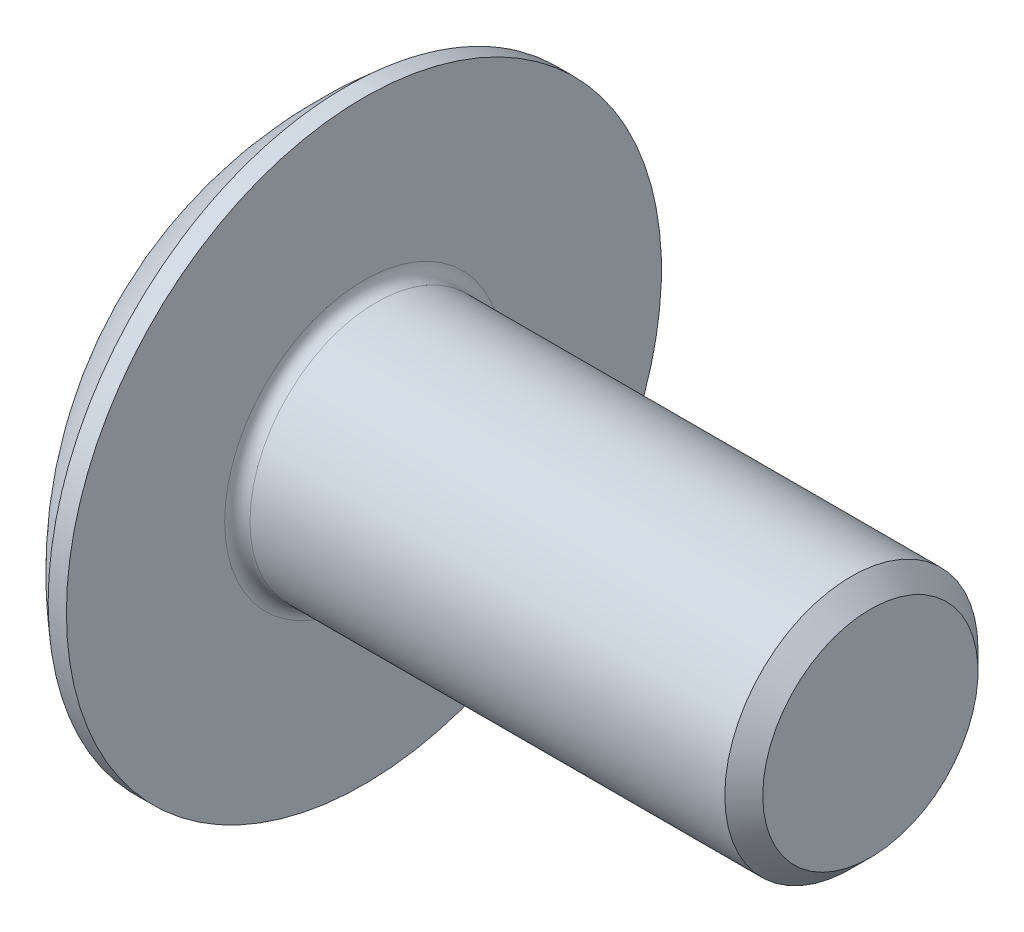
ISO-10303-21;
HEADER;
FILE_DESCRIPTION(('STEP AP214'),'2;1');
FILE_NAME('part.step','',(''),(''),'','','');
FILE_SCHEMA(('AUTOMOTIVE_DESIGN { 1 0 10303 214 1 1 1 1 }'));
ENDSEC;
DATA;
#1=APPLICATION_CONTEXT('core data for automotive mechanical design processes');
#2=APPLICATION_PROTOCOL_DEFINITION('international standard','automotive_design',2000,#1);
#3=PRODUCT_CONTEXT('',#1,'mechanical');
#4=PRODUCT('Part','Part','',(#3));
#5=PRODUCT_RELATED_PRODUCT_CATEGORY('part','',(#4));
#6=PRODUCT_DEFINITION_FORMATION('','',#4);
#7=PRODUCT_DEFINITION_CONTEXT('part definition',#1,'design');
#8=PRODUCT_DEFINITION('design','',#6,#7);
#9=PRODUCT_DEFINITION_SHAPE('','',#8);
#10=(LENGTH_UNIT() NAMED_UNIT(*) SI_UNIT(.MILLI.,.METRE.));
#11=(NAMED_UNIT(*) PLANE_ANGLE_UNIT() SI_UNIT($,.RADIAN.));
#12=(NAMED_UNIT(*) SI_UNIT($,.STERADIAN.) SOLID_ANGLE_UNIT());
#13=UNCERTAINTY_MEASURE_WITH_UNIT(LENGTH_MEASURE(1.E-05),#10,'distance_accuracy_value','');
#14=(GEOMETRIC_REPRESENTATION_CONTEXT(3) GLOBAL_UNCERTAINTY_ASSIGNED_CONTEXT((#13)) GLOBAL_UNIT_ASSIGNED_CONTEXT((#10,
#11,#12)) REPRESENTATION_CONTEXT('',''));
#15=CARTESIAN_POINT('',(0.,0.,0.));
#16=DIRECTION('',(0.,0.,1.));
#17=DIRECTION('',(1.,0.,0.));
#18=AXIS2_PLACEMENT_3D('',#15,#16,#17);
#19=CARTESIAN_POINT('',(0.,-2.15,-0.515));
#20=DIRECTION('',(0.446197753347436,-0.894934391398443,0.));
#21=DIRECTION('',(0.894934391398443,0.446197753347436,0.));
#22=AXIS2_PLACEMENT_3D('',#19,#20,#21);
#23=PLANE('',#22);
#24=DIRECTION('',(0.,0.,1.));
#25=VECTOR('',#24,1.);
#26=CARTESIAN_POINT('',(2.12999999999999,-1.08802135244247,-0.515));
#27=LINE('',#26,#25);
#28=CARTESIAN_POINT('',(2.12999999999999,-1.08802135244247,-0.515));
#29=VERTEX_POINT('',#28);
#30=CARTESIAN_POINT('',(2.12999999999999,-1.08802135244247,0.515));
#31=VERTEX_POINT('',#30);
#32=EDGE_CURVE('E160',#29,#31,#27,.T.);
#33=ORIENTED_EDGE('',*,*,#32,.F.);
#34=DIRECTION('',(0.894934391398443,0.446197753347434,0.));
#35=VECTOR('',#34,1.);
#36=CARTESIAN_POINT('',(0.351508113671697,-1.97474454874996,-0.515));
#37=LINE('',#36,#35);
#38=CARTESIAN_POINT('',(0.351508113671697,-1.97474454874997,-0.515000000000001));
#39=VERTEX_POINT('',#38);
#40=EDGE_CURVE('E142',#39,#29,#37,.T.);
#41=ORIENTED_EDGE('',*,*,#40,.F.);
#42=CARTESIAN_POINT('',(0.351508113671696,-1.97474454874997,0.514999999999999));
#43=CARTESIAN_POINT('',(0.338401527680641,-1.98127925037666,0.343333333333332));
#44=CARTESIAN_POINT('',(0.331848234685115,-1.98454660119001,0.171666666666666));
#45=CARTESIAN_POINT('',(0.331848234685121,-1.98454660119003,-0.171666666666674));
#46=CARTESIAN_POINT('',(0.338401527680654,-1.98127925037669,-0.343333333333347));
#47=CARTESIAN_POINT('',(0.351508113671716,-1.97474454875002,-0.51500000000002));
#48=B_SPLINE_CURVE_WITH_KNOTS('',3,(#42,#43,#44,#45,#46,#47),.UNSPECIFIED.,.F.,.F.,(4,2,4),(0.,
0.515468322085658,1.03093664417134),.UNSPECIFIED.);
#49=CARTESIAN_POINT('',(0.351508113671697,-1.97474454874997,0.514999999999999));
#50=VERTEX_POINT('',#49);
#51=EDGE_CURVE('E153',#50,#39,#48,.T.);
#52=ORIENTED_EDGE('',*,*,#51,.F.);
#53=DIRECTION('',(-0.894934391398443,-0.446197753347434,0.));
#54=VECTOR('',#53,1.);
#55=CARTESIAN_POINT('',(2.12999999999999,-1.08802135244247,0.515));
#56=LINE('',#55,#54);
#57=EDGE_CURVE('E174',#31,#50,#56,.T.);
#58=ORIENTED_EDGE('',*,*,#57,.F.);
#59=EDGE_LOOP('',(#33,#41,#52,#58));
#60=FACE_BOUND('',#59,.T.);
#61=ADVANCED_FACE('F17',(#60),#23,.F.);
#62=CARTESIAN_POINT('',(0.,-2.15,0.514999999999999));
#63=DIRECTION('',(0.,0.,-1.));
#64=DIRECTION('',(0.,1.,0.));
#65=AXIS2_PLACEMENT_3D('',#62,#63,#64);
#66=PLANE('',#65);
#67=DIRECTION('',(0.,1.,0.));
#68=VECTOR('',#67,1.);
#69=CARTESIAN_POINT('',(2.12999999999999,-2.15,0.515));
#70=LINE('',#69,#68);
#71=CARTESIAN_POINT('',(2.13000000001115,-0.677477674911631,0.515));
#72=VERTEX_POINT('',#71);
#73=EDGE_CURVE('E178',#72,#31,#70,.F.);
#74=ORIENTED_EDGE('',*,*,#73,.T.);
#75=ORIENTED_EDGE('',*,*,#57,.T.);
#76=CARTESIAN_POINT('',(0.351508113671694,-1.97474454874997,0.514999999999999));
#77=CARTESIAN_POINT('',(0.288655879890495,-1.79165319179448,0.515000000000059));
#78=CARTESIAN_POINT('',(0.234735010530897,-1.60641743663807,0.515000000000059));
#79=CARTESIAN_POINT('',(0.144756000654907,-1.2316571299234,0.51499999999994));
#80=CARTESIAN_POINT('',(0.108697860138513,-1.04213257836513,0.514999999999819));
#81=CARTESIAN_POINT('',(0.0815710840437224,-0.850463628605944,0.514999999999639));
#82=B_SPLINE_CURVE_WITH_KNOTS('',3,(#76,#77,#78,#79,#80,#81),.UNSPECIFIED.,.F.,.F.,(4,2,4),(0.,
0.578772585967706,1.15754517193541),.UNSPECIFIED.);
#83=CARTESIAN_POINT('',(0.0815710840406824,-0.850463628609745,0.514999999999999));
#84=VERTEX_POINT('',#83);
#85=EDGE_CURVE('E156',#50,#84,#82,.T.);
#86=ORIENTED_EDGE('',*,*,#85,.T.);
#87=CARTESIAN_POINT('',(0.081571084037665,-0.850463628613819,0.515));
#88=CARTESIAN_POINT('',(0.252311809699792,-0.836504687710256,0.515));
#89=CARTESIAN_POINT('',(0.423045275412838,-0.822456452597831,0.515));
#90=CARTESIAN_POINT('',(0.764494084107846,-0.794146118418241,0.515));
#91=CARTESIAN_POINT('',(0.935209427129371,-0.779884019828062,0.515));
#92=CARTESIAN_POINT('',(1.27661924018114,-0.751110613541294,0.515));
#93=CARTESIAN_POINT('',(1.44731371020021,-0.736599305711798,0.515));
#94=CARTESIAN_POINT('',(1.78867722759656,-0.707276432322749,0.515));
#95=CARTESIAN_POINT('',(1.95934627491616,-0.692464866092075,0.515));
#96=CARTESIAN_POINT('',(2.13000000000769,-0.67747767491284,0.515));
#97=B_SPLINE_CURVE_WITH_KNOTS('',3,(#87,#88,#89,#90,#91,#92,#93,#94,#95,#96),.UNSPECIFIED.,.F.,
.F.,(4,2,2,2,4),(0.,0.51393118310658,1.02786122014767,1.54179153128014,2.05572299124684),.UNSPECIFIED.);
#98=EDGE_CURVE('E163',#84,#72,#97,.T.);
#99=ORIENTED_EDGE('',*,*,#98,.T.);
#100=EDGE_LOOP('',(#74,#75,#86,#99));
#101=FACE_BOUND('',#100,.T.);
#102=ADVANCED_FACE('F345',(#101),#66,.T.);
#103=CARTESIAN_POINT('',(0.,2.15,-0.515));
#104=DIRECTION('',(0.,0.,1.));
#105=DIRECTION('',(1.,0.,0.));
#106=AXIS2_PLACEMENT_3D('',#103,#104,#105);
#107=PLANE('',#106);
#108=CARTESIAN_POINT('',(0.0815710840436999,-0.85046362860567,-0.515000000000001));
#109=CARTESIAN_POINT('',(0.108697860138481,-1.04213257836491,-0.515));
#110=CARTESIAN_POINT('',(0.144756000654872,-1.23165712992322,-0.515));
#111=CARTESIAN_POINT('',(0.234735010530871,-1.60641743663798,-0.515));
#112=CARTESIAN_POINT('',(0.288655879890479,-1.79165319179444,-0.515));
#113=CARTESIAN_POINT('',(0.351508113671696,-1.97474454874996,-0.515000000000001));
#114=B_SPLINE_CURVE_WITH_KNOTS('',3,(#108,#109,#110,#111,#112,#113),.UNSPECIFIED.,.F.,.F.,(4,2,
4),(0.,0.578772585967842,1.15754517193568),.UNSPECIFIED.);
#115=CARTESIAN_POINT('',(0.0815710840339949,-0.850463628610291,-0.515));
#116=VERTEX_POINT('',#115);
#117=EDGE_CURVE('E138',#116,#39,#114,.T.);
#118=ORIENTED_EDGE('',*,*,#117,.T.);
#119=ORIENTED_EDGE('',*,*,#40,.T.);
#120=DIRECTION('',(0.,1.,0.));
#121=VECTOR('',#120,1.);
#122=CARTESIAN_POINT('',(2.12999999999999,2.15,-0.515));
#123=LINE('',#122,#121);
#124=CARTESIAN_POINT('',(2.13000000001115,-0.67747767491163,-0.515));
#125=VERTEX_POINT('',#124);
#126=EDGE_CURVE('E149',#29,#125,#123,.T.);
#127=ORIENTED_EDGE('',*,*,#126,.T.);
#128=CARTESIAN_POINT('',(2.13000000000769,-0.677477674912839,-0.515));
#129=CARTESIAN_POINT('',(1.86584449274978,-0.700665964700927,-0.515));
#130=CARTESIAN_POINT('',(1.60165393521883,-0.723449597903128,-0.515));
#131=CARTESIAN_POINT('',(1.07321785660368,-0.768361249794709,-0.515));
#132=CARTESIAN_POINT('',(0.808972335691568,-0.790489270506565,-0.515));
#133=CARTESIAN_POINT('',(0.390334349722067,-0.825145981613071,-0.515));
#134=CARTESIAN_POINT('',(0.235955539790427,-0.837839948077561,-0.515));
#135=CARTESIAN_POINT('',(0.0815710840376651,-0.850463628613818,-0.515));
#136=B_SPLINE_CURVE_WITH_KNOTS('',3,(#128,#129,#130,#131,#132,#133,#134,#135),.UNSPECIFIED.,.F.,
.F.,(4,2,2,4),(0.,0.795512958245384,1.59102346218593,2.05572275095712),.UNSPECIFIED.);
#137=EDGE_CURVE('E145',#125,#116,#136,.T.);
#138=ORIENTED_EDGE('',*,*,#137,.T.);
#139=EDGE_LOOP('',(#118,#119,#127,#138));
#140=FACE_BOUND('',#139,.T.);
#141=ADVANCED_FACE('F140',(#140),#107,.T.);
#142=CARTESIAN_POINT('',(0.0815710841379769,0.,0.));
#143=DIRECTION('',(-1.,0.,0.));
#144=DIRECTION('',(0.,0.,1.));
#145=AXIS2_PLACEMENT_3D('',#142,#143,#144);
#146=CONICAL_SURFACE('',#145,0.994240103587174,0.0698131700819038);
#147=CARTESIAN_POINT('',(2.13000000000403,-0.514999999999998,0.677477674913162));
#148=CARTESIAN_POINT('',(1.86584449274605,-0.514999999999998,0.700665964701253));
#149=CARTESIAN_POINT('',(1.60165393521502,-0.514999999999998,0.723449597903456));
#150=CARTESIAN_POINT('',(1.07321785659971,-0.514999999999998,0.768361249795044));
#151=CARTESIAN_POINT('',(0.808972335687516,-0.514999999999999,0.790489270506904));
#152=CARTESIAN_POINT('',(0.390334349720403,-0.514999999999999,0.825145981613208));
#153=CARTESIAN_POINT('',(0.235955539791232,-0.514999999999999,0.837839948077495));
#154=CARTESIAN_POINT('',(0.0815710840409379,-0.514999999999999,0.850463628613552));
#155=B_SPLINE_CURVE_WITH_KNOTS('',3,(#147,#148,#149,#150,#151,#152,#153,#154),.UNSPECIFIED.,.F.,
.F.,(4,2,2,4),(0.,0.795512958245623,1.59102346218641,2.05572275095017),.UNSPECIFIED.);
#156=CARTESIAN_POINT('',(2.13000000001115,-0.514999999999998,0.677477674911632));
#157=VERTEX_POINT('',#156);
#158=CARTESIAN_POINT('',(0.081571084032614,-0.514999999999998,0.850463628577579));
#159=VERTEX_POINT('',#158);
#160=EDGE_CURVE('E314',#157,#159,#155,.T.);
#161=ORIENTED_EDGE('',*,*,#160,.F.);
#162=CARTESIAN_POINT('',(2.13000000002239,0.,0.));
#163=DIRECTION('',(-1.,0.,0.));
#164=DIRECTION('',(0.,0.,1.));
#165=AXIS2_PLACEMENT_3D('',#162,#163,#164);
#166=CIRCLE('',#165,0.851000000004376);
#167=EDGE_CURVE('E166',#72,#157,#166,.T.);
#168=ORIENTED_EDGE('',*,*,#167,.F.);
#169=ORIENTED_EDGE('',*,*,#98,.F.);
#170=CARTESIAN_POINT('',(0.08157108402429,0.,0.));
#171=DIRECTION('',(-1.,0.,0.));
#172=DIRECTION('',(0.,0.,1.));
#173=AXIS2_PLACEMENT_3D('',#170,#171,#172);
#174=CIRCLE('',#173,0.994240103595124);
#175=EDGE_CURVE('E325',#159,#84,#174,.F.);
#176=ORIENTED_EDGE('',*,*,#175,.F.);
#177=EDGE_LOOP('',(#161,#168,#169,#176));
#178=FACE_BOUND('',#177,.T.);
#179=ADVANCED_FACE('F344',(#178),#146,.F.);
#180=CARTESIAN_POINT('',(0.0815710841379769,0.,0.));
#181=DIRECTION('',(-1.,0.,0.));
#182=DIRECTION('',(0.,0.,1.));
#183=AXIS2_PLACEMENT_3D('',#180,#181,#182);
#184=CONICAL_SURFACE('',#183,0.994240103587174,0.0698131700819038);
#185=CARTESIAN_POINT('',(0.081571084040938,-0.514999999999992,-0.850463628613556));
#186=CARTESIAN_POINT('',(0.252311809702488,-0.514999999999993,-0.836504687710039));
#187=CARTESIAN_POINT('',(0.423045275414957,-0.514999999999993,-0.82245645259766));
#188=CARTESIAN_POINT('',(0.764494084108809,-0.514999999999993,-0.794146118418165));
#189=CARTESIAN_POINT('',(0.935209427129757,-0.514999999999993,-0.779884019828034));
#190=CARTESIAN_POINT('',(1.27661924018037,-0.514999999999993,-0.751110613541363));
#191=CARTESIAN_POINT('',(1.44731371019886,-0.514999999999993,-0.736599305711918));
#192=CARTESIAN_POINT('',(1.78867722759406,-0.514999999999993,-0.70727643232297));
#193=CARTESIAN_POINT('',(1.95934627491308,-0.514999999999993,-0.692464866092348));
#194=CARTESIAN_POINT('',(2.13000000000403,-0.514999999999993,-0.677477674913165));
#195=B_SPLINE_CURVE_WITH_KNOTS('',3,(#185,#186,#187,#188,#189,#190,#191,#192,#193,#194),
.UNSPECIFIED.,.F.,.F.,(4,2,2,2,4),(0.,0.513931183104842,1.0278612201442,1.54179153127493,
2.05572299123989),.UNSPECIFIED.);
#196=CARTESIAN_POINT('',(0.08157108402429,-0.514999999999991,-0.850463628578271));
#197=VERTEX_POINT('',#196);
#198=CARTESIAN_POINT('',(2.13000000001115,-0.514999999999993,-0.677477674911635));
#199=VERTEX_POINT('',#198);
#200=EDGE_CURVE('E308',#197,#199,#195,.T.);
#201=ORIENTED_EDGE('',*,*,#200,.F.);
#202=CARTESIAN_POINT('',(0.08157108402429,0.,0.));
#203=DIRECTION('',(-1.,0.,0.));
#204=DIRECTION('',(0.,0.,1.));
#205=AXIS2_PLACEMENT_3D('',#202,#203,#204);
#206=CIRCLE('',#205,0.994240103595124);
#207=EDGE_CURVE('E318',#116,#197,#206,.F.);
#208=ORIENTED_EDGE('',*,*,#207,.F.);
#209=ORIENTED_EDGE('',*,*,#137,.F.);
#210=CARTESIAN_POINT('',(2.13000000002239,0.,0.));
#211=DIRECTION('',(-1.,0.,0.));
#212=DIRECTION('',(0.,0.,1.));
#213=AXIS2_PLACEMENT_3D('',#210,#211,#212);
#214=CIRCLE('',#213,0.851000000004376);
#215=EDGE_CURVE('E315',#199,#125,#214,.T.);
#216=ORIENTED_EDGE('',*,*,#215,.F.);
#217=EDGE_LOOP('',(#201,#208,#209,#216));
#218=FACE_BOUND('',#217,.T.);
#219=ADVANCED_FACE('F340',(#218),#184,.F.);
#220=CARTESIAN_POINT('',(0.,-0.514999999999988,-2.15));
#221=DIRECTION('',(0.,1.,0.));
#222=DIRECTION('',(0.,0.,1.));
#223=AXIS2_PLACEMENT_3D('',#220,#221,#222);
#224=PLANE('',#223);
#225=CARTESIAN_POINT('',(6.09999999999999,-0.514999999999998,0.));
#226=DIRECTION('',(0.,1.,0.));
#227=DIRECTION('',(0.,0.,1.));
#228=AXIS2_PLACEMENT_3D('',#225,#226,#227);
#229=CIRCLE('',#228,6.07822136813064);
#230=CARTESIAN_POINT('',(0.351508113671697,-0.515,1.97474454874996));
#231=VERTEX_POINT('',#230);
#232=EDGE_CURVE('E688',#159,#231,#229,.T.);
#233=ORIENTED_EDGE('',*,*,#232,.T.);
#234=DIRECTION('',(0.894934391398442,0.,-0.446197753347436));
#235=VECTOR('',#234,1.);
#236=CARTESIAN_POINT('',(2.12999999999999,-0.515000000000002,1.08802135244247));
#237=LINE('',#236,#235);
#238=CARTESIAN_POINT('',(2.12999999999999,-0.515000000000001,1.08802135244247));
#239=VERTEX_POINT('',#238);
#240=EDGE_CURVE('E296',#231,#239,#237,.T.);
#241=ORIENTED_EDGE('',*,*,#240,.T.);
#242=DIRECTION('',(0.,0.,1.));
#243=VECTOR('',#242,1.);
#244=CARTESIAN_POINT('',(2.12999999999999,-0.514999999999988,-2.15));
#245=LINE('',#244,#243);
#246=EDGE_CURVE('E311',#239,#157,#245,.F.);
#247=ORIENTED_EDGE('',*,*,#246,.T.);
#248=ORIENTED_EDGE('',*,*,#160,.T.);
#249=EDGE_LOOP('',(#233,#241,#247,#248));
#250=FACE_BOUND('',#249,.T.);
#251=ADVANCED_FACE('F543',(#250),#224,.T.);
#252=CARTESIAN_POINT('',(0.,-0.514999999999988,-2.15));
#253=DIRECTION('',(0.,1.,0.));
#254=DIRECTION('',(0.,0.,1.));
#255=AXIS2_PLACEMENT_3D('',#252,#253,#254);
#256=PLANE('',#255);
#257=DIRECTION('',(0.,0.,1.));
#258=VECTOR('',#257,1.);
#259=CARTESIAN_POINT('',(2.12999999999999,-0.514999999999988,-2.15));
#260=LINE('',#259,#258);
#261=CARTESIAN_POINT('',(2.12999999999999,-0.514999999999998,-1.08802135244247));
#262=VERTEX_POINT('',#261);
#263=EDGE_CURVE('E306',#199,#262,#260,.F.);
#264=ORIENTED_EDGE('',*,*,#263,.T.);
#265=DIRECTION('',(-0.894934391398443,0.,-0.446197753347436));
#266=VECTOR('',#265,1.);
#267=CARTESIAN_POINT('',(0.,-0.515000000000002,-2.15));
#268=LINE('',#267,#266);
#269=CARTESIAN_POINT('',(0.351508113671696,-0.51499999999999,-1.97474454874997));
#270=VERTEX_POINT('',#269);
#271=EDGE_CURVE('E286',#262,#270,#268,.T.);
#272=ORIENTED_EDGE('',*,*,#271,.T.);
#273=CARTESIAN_POINT('',(6.09999999999999,-0.514999999999989,0.));
#274=DIRECTION('',(0.,1.,0.));
#275=DIRECTION('',(0.,0.,1.));
#276=AXIS2_PLACEMENT_3D('',#273,#274,#275);
#277=CIRCLE('',#276,6.07822136813065);
#278=EDGE_CURVE('E686',#270,#197,#277,.T.);
#279=ORIENTED_EDGE('',*,*,#278,.T.);
#280=ORIENTED_EDGE('',*,*,#200,.T.);
#281=EDGE_LOOP('',(#264,#272,#279,#280));
#282=FACE_BOUND('',#281,.T.);
#283=ADVANCED_FACE('F535',(#282),#256,.T.);
#284=CARTESIAN_POINT('',(2.12999999999999,-0.515000000000002,1.08802135244247));
#285=DIRECTION('',(0.446197753347436,0.,0.894934391398442));
#286=DIRECTION('',(0.894934391398442,0.,-0.446197753347436));
#287=AXIS2_PLACEMENT_3D('',#284,#285,#286);
#288=PLANE('',#287);
#289=DIRECTION('',(0.,1.,0.));
#290=VECTOR('',#289,1.);
#291=CARTESIAN_POINT('',(2.12999999999999,-0.515000000000002,1.08802135244247));
#292=LINE('',#291,#290);
#293=CARTESIAN_POINT('',(2.12999999999999,0.514999999999998,1.08802135244247));
#294=VERTEX_POINT('',#293);
#295=EDGE_CURVE('E299',#239,#294,#292,.T.);
#296=ORIENTED_EDGE('',*,*,#295,.F.);
#297=ORIENTED_EDGE('',*,*,#240,.F.);
#298=CARTESIAN_POINT('',(0.351508113671696,0.514999999999991,1.97474454874997));
#299=CARTESIAN_POINT('',(0.338401527680642,0.343333333333325,1.98127925037667));
#300=CARTESIAN_POINT('',(0.331848234685116,0.17166666666666,1.98454660119002));
#301=CARTESIAN_POINT('',(0.331848234685116,-0.171666666666671,1.98454660119002));
#302=CARTESIAN_POINT('',(0.338401527680643,-0.343333333333337,1.98127925037667));
#303=CARTESIAN_POINT('',(0.351508113671696,-0.515000000000002,1.97474454874996));
#304=B_SPLINE_CURVE_WITH_KNOTS('',3,(#298,#299,#300,#301,#302,#303),.UNSPECIFIED.,.F.,.F.,(4,2,
4),(0.,0.515468322085655,1.03093664417131),.UNSPECIFIED.);
#305=CARTESIAN_POINT('',(0.351508113671695,0.514999999999985,1.97474454874997));
#306=VERTEX_POINT('',#305);
#307=EDGE_CURVE('E300',#306,#231,#304,.T.);
#308=ORIENTED_EDGE('',*,*,#307,.F.);
#309=DIRECTION('',(-0.894934391398442,0.,0.446197753347437));
#310=VECTOR('',#309,1.);
#311=CARTESIAN_POINT('',(2.12999999999999,0.514999999999991,1.08802135244247));
#312=LINE('',#311,#310);
#313=EDGE_CURVE('E280',#294,#306,#312,.T.);
#314=ORIENTED_EDGE('',*,*,#313,.F.);
#315=EDGE_LOOP('',(#296,#297,#308,#314));
#316=FACE_BOUND('',#315,.T.);
#317=ADVANCED_FACE('F527',(#316),#288,.F.);
#318=CARTESIAN_POINT('',(2.12999999999999,1.08802135244247,-0.515));
#319=DIRECTION('',(-1.,0.,0.));
#320=DIRECTION('',(0.,0.,1.));
#321=AXIS2_PLACEMENT_3D('',#318,#319,#320);
#322=PLANE('',#321);
#323=ORIENTED_EDGE('',*,*,#126,.F.);
#324=ORIENTED_EDGE('',*,*,#32,.T.);
#325=ORIENTED_EDGE('',*,*,#73,.F.);
#326=CARTESIAN_POINT('',(2.1299999999999,0.,0.));
#327=DIRECTION('',(-1.,0.,0.));
#328=DIRECTION('',(0.,0.,1.));
#329=AXIS2_PLACEMENT_3D('',#326,#327,#328);
#330=CIRCLE('',#329,0.850999999999935);
#331=EDGE_CURVE('E272',#72,#125,#330,.F.);
#332=ORIENTED_EDGE('',*,*,#331,.T.);
#333=EDGE_LOOP('',(#323,#324,#325,#332));
#334=FACE_BOUND('',#333,.T.);
#335=ADVANCED_FACE('F519',(#334),#322,.T.);
#336=CARTESIAN_POINT('',(0.,0.515000000000002,-2.15));
#337=DIRECTION('',(0.446197753347436,0.,-0.894934391398443));
#338=DIRECTION('',(-0.894934391398443,0.,-0.446197753347436));
#339=AXIS2_PLACEMENT_3D('',#336,#337,#338);
#340=PLANE('',#339);
#341=DIRECTION('',(0.,1.,0.));
#342=VECTOR('',#341,1.);
#343=CARTESIAN_POINT('',(2.12999999999999,1.08802135244247,-1.08802135244247));
#344=LINE('',#343,#342);
#345=CARTESIAN_POINT('',(2.12999999999999,0.515,-1.08802135244247));
#346=VERTEX_POINT('',#345);
#347=EDGE_CURVE('E277',#346,#262,#344,.F.);
#348=ORIENTED_EDGE('',*,*,#347,.F.);
#349=DIRECTION('',(0.894934391398441,0.,0.446197753347438));
#350=VECTOR('',#349,1.);
#351=CARTESIAN_POINT('',(0.351508113671704,0.515000000000002,-1.97474454874997));
#352=LINE('',#351,#350);
#353=CARTESIAN_POINT('',(0.351508113671696,0.515000000000002,-1.97474454874997));
#354=VERTEX_POINT('',#353);
#355=EDGE_CURVE('E263',#354,#346,#352,.T.);
#356=ORIENTED_EDGE('',*,*,#355,.F.);
#357=CARTESIAN_POINT('',(0.351508113671696,-0.514999999999991,-1.97474454874997));
#358=CARTESIAN_POINT('',(0.338401527680643,-0.343333333333326,-1.98127925037667));
#359=CARTESIAN_POINT('',(0.331848234685117,-0.17166666666666,-1.98454660119002));
#360=CARTESIAN_POINT('',(0.331848234685117,0.171666666666671,-1.98454660119002));
#361=CARTESIAN_POINT('',(0.338401527680643,0.343333333333336,-1.98127925037667));
#362=CARTESIAN_POINT('',(0.351508113671695,0.515000000000002,-1.97474454874996));
#363=B_SPLINE_CURVE_WITH_KNOTS('',3,(#357,#358,#359,#360,#361,#362),.UNSPECIFIED.,.F.,.F.,(4,2,
4),(0.,0.515468322085655,1.03093664417131),.UNSPECIFIED.);
#364=EDGE_CURVE('E289',#270,#354,#363,.T.);
#365=ORIENTED_EDGE('',*,*,#364,.F.);
#366=ORIENTED_EDGE('',*,*,#271,.F.);
#367=EDGE_LOOP('',(#348,#356,#365,#366));
#368=FACE_BOUND('',#367,.T.);
#369=ADVANCED_FACE('F511',(#368),#340,.F.);
#370=CARTESIAN_POINT('',(0.,0.514999999999988,2.15));
#371=DIRECTION('',(0.,-1.,0.));
#372=DIRECTION('',(0.,0.,-1.));
#373=AXIS2_PLACEMENT_3D('',#370,#371,#372);
#374=PLANE('',#373);
#375=DIRECTION('',(0.,0.,1.));
#376=VECTOR('',#375,1.);
#377=CARTESIAN_POINT('',(2.12999999999999,0.515000000000002,-0.515));
#378=LINE('',#377,#376);
#379=CARTESIAN_POINT('',(2.13000000000196,0.514999999999997,0.677477674911003));
#380=VERTEX_POINT('',#379);
#381=EDGE_CURVE('E275',#294,#380,#378,.F.);
#382=ORIENTED_EDGE('',*,*,#381,.F.);
#383=ORIENTED_EDGE('',*,*,#313,.T.);
#384=CARTESIAN_POINT('',(6.09999999999999,0.514999999999988,0.));
#385=DIRECTION('',(0.,1.,0.));
#386=DIRECTION('',(0.,0.,1.));
#387=AXIS2_PLACEMENT_3D('',#384,#385,#386);
#388=CIRCLE('',#387,6.07822136813065);
#389=CARTESIAN_POINT('',(0.0815710840309781,0.51499999999999,0.850463628577725));
#390=VERTEX_POINT('',#389);
#391=EDGE_CURVE('E283',#306,#390,#388,.F.);
#392=ORIENTED_EDGE('',*,*,#391,.T.);
#393=CARTESIAN_POINT('',(0.0815710840376661,0.514999999999992,0.850463628613823));
#394=CARTESIAN_POINT('',(0.252311809699488,0.514999999999992,0.836504687710285));
#395=CARTESIAN_POINT('',(0.423045275412229,0.514999999999992,0.822456452597885));
#396=CARTESIAN_POINT('',(0.764494084106626,0.514999999999992,0.794146118418347));
#397=CARTESIAN_POINT('',(0.935209427127847,0.514999999999992,0.779884019828195));
#398=CARTESIAN_POINT('',(1.27661924017901,0.514999999999993,0.751110613541479));
#399=CARTESIAN_POINT('',(1.44731371019777,0.514999999999993,0.736599305712011));
#400=CARTESIAN_POINT('',(1.78867722759351,0.514999999999993,0.707276432323018));
#401=CARTESIAN_POINT('',(1.9593462749128,0.514999999999993,0.692464866092373));
#402=CARTESIAN_POINT('',(2.13000000000403,0.514999999999993,0.677477674913166));
#403=B_SPLINE_CURVE_WITH_KNOTS('',3,(#393,#394,#395,#396,#397,#398,#399,#400,#401,#402),
.UNSPECIFIED.,.F.,.F.,(4,2,2,2,4),(0.,0.513931183105661,1.02786122014584,1.54179153127739,
2.05572299124317),.UNSPECIFIED.);
#404=EDGE_CURVE('E713',#390,#380,#403,.T.);
#405=ORIENTED_EDGE('',*,*,#404,.T.);
#406=EDGE_LOOP('',(#382,#383,#392,#405));
#407=FACE_BOUND('',#406,.T.);
#408=ADVANCED_FACE('F503',(#407),#374,.T.);
#409=CARTESIAN_POINT('',(2.12999999999999,1.08802135244247,-0.515));
#410=DIRECTION('',(-1.,0.,0.));
#411=DIRECTION('',(0.,0.,1.));
#412=AXIS2_PLACEMENT_3D('',#409,#410,#411);
#413=PLANE('',#412);
#414=DIRECTION('',(0.,0.,-1.));
#415=VECTOR('',#414,1.);
#416=CARTESIAN_POINT('',(2.12999999999999,0.514999999999988,2.15));
#417=LINE('',#416,#415);
#418=CARTESIAN_POINT('',(2.13000000001115,0.514999999999998,-0.677477674911632));
#419=VERTEX_POINT('',#418);
#420=EDGE_CURVE('E270',#346,#419,#417,.F.);
#421=ORIENTED_EDGE('',*,*,#420,.F.);
#422=ORIENTED_EDGE('',*,*,#347,.T.);
#423=ORIENTED_EDGE('',*,*,#263,.F.);
#424=CARTESIAN_POINT('',(2.1299999999999,0.,0.));
#425=DIRECTION('',(-1.,0.,0.));
#426=DIRECTION('',(0.,0.,1.));
#427=AXIS2_PLACEMENT_3D('',#424,#425,#426);
#428=CIRCLE('',#427,0.850999999999935);
#429=EDGE_CURVE('E262',#199,#419,#428,.F.);
#430=ORIENTED_EDGE('',*,*,#429,.T.);
#431=EDGE_LOOP('',(#421,#422,#423,#430));
#432=FACE_BOUND('',#431,.T.);
#433=ADVANCED_FACE('F495',(#432),#413,.T.);
#434=CARTESIAN_POINT('',(2.12999999999999,1.08802135244247,-0.515));
#435=DIRECTION('',(-1.,0.,0.));
#436=DIRECTION('',(0.,0.,1.));
#437=AXIS2_PLACEMENT_3D('',#434,#435,#436);
#438=PLANE('',#437);
#439=ORIENTED_EDGE('',*,*,#246,.F.);
#440=ORIENTED_EDGE('',*,*,#295,.T.);
#441=ORIENTED_EDGE('',*,*,#381,.T.);
#442=CARTESIAN_POINT('',(2.1299999999999,0.,0.));
#443=DIRECTION('',(-1.,0.,0.));
#444=DIRECTION('',(0.,0.,1.));
#445=AXIS2_PLACEMENT_3D('',#442,#443,#444);
#446=CIRCLE('',#445,0.850999999999935);
#447=EDGE_CURVE('E258',#380,#157,#446,.F.);
#448=ORIENTED_EDGE('',*,*,#447,.T.);
#449=EDGE_LOOP('',(#439,#440,#441,#448));
#450=FACE_BOUND('',#449,.T.);
#451=ADVANCED_FACE('F487',(#450),#438,.T.);
#452=CARTESIAN_POINT('',(0.,0.514999999999988,2.15));
#453=DIRECTION('',(0.,-1.,0.));
#454=DIRECTION('',(0.,0.,-1.));
#455=AXIS2_PLACEMENT_3D('',#452,#453,#454);
#456=PLANE('',#455);
#457=CARTESIAN_POINT('',(6.09999999999999,0.514999999999997,0.));
#458=DIRECTION('',(0.,1.,0.));
#459=DIRECTION('',(0.,0.,1.));
#460=AXIS2_PLACEMENT_3D('',#457,#458,#459);
#461=CIRCLE('',#460,6.07822136813065);
#462=CARTESIAN_POINT('',(0.08157108402429,0.514999999999997,-0.850463628578265));
#463=VERTEX_POINT('',#462);
#464=EDGE_CURVE('E267',#463,#354,#461,.F.);
#465=ORIENTED_EDGE('',*,*,#464,.T.);
#466=ORIENTED_EDGE('',*,*,#355,.T.);
#467=ORIENTED_EDGE('',*,*,#420,.T.);
#468=CARTESIAN_POINT('',(2.13000000000769,0.514999999999998,-0.677477674912841));
#469=CARTESIAN_POINT('',(1.86584449274978,0.514999999999998,-0.700665964700929));
#470=CARTESIAN_POINT('',(1.60165393521883,0.514999999999998,-0.72344959790313));
#471=CARTESIAN_POINT('',(1.07321785660368,0.514999999999998,-0.768361249794711));
#472=CARTESIAN_POINT('',(0.808972335691569,0.514999999999998,-0.790489270506566));
#473=CARTESIAN_POINT('',(0.390334349722067,0.514999999999998,-0.825145981613072));
#474=CARTESIAN_POINT('',(0.235955539790428,0.514999999999998,-0.837839948077562));
#475=CARTESIAN_POINT('',(0.081571084037666,0.514999999999998,-0.850463628613819));
#476=B_SPLINE_CURVE_WITH_KNOTS('',3,(#468,#469,#470,#471,#472,#473,#474,#475),.UNSPECIFIED.,.F.,
.F.,(4,2,2,4),(0.,0.795512958245384,1.59102346218593,2.05572275095712),.UNSPECIFIED.);
#477=EDGE_CURVE('E257',#419,#463,#476,.T.);
#478=ORIENTED_EDGE('',*,*,#477,.T.);
#479=EDGE_LOOP('',(#465,#466,#467,#478));
#480=FACE_BOUND('',#479,.T.);
#481=ADVANCED_FACE('F479',(#480),#456,.T.);
#482=CARTESIAN_POINT('',(0.0815710841379769,0.,0.));
#483=DIRECTION('',(-1.,0.,0.));
#484=DIRECTION('',(0.,0.,1.));
#485=AXIS2_PLACEMENT_3D('',#482,#483,#484);
#486=CONICAL_SURFACE('',#485,0.994240103587174,0.0698131700819038);
#487=ORIENTED_EDGE('',*,*,#404,.F.);
#488=CARTESIAN_POINT('',(0.08157108402429,0.,0.));
#489=DIRECTION('',(-1.,0.,0.));
#490=DIRECTION('',(0.,0.,1.));
#491=AXIS2_PLACEMENT_3D('',#488,#489,#490);
#492=CIRCLE('',#491,0.994240103595124);
#493=CARTESIAN_POINT('',(0.0815710840326135,0.850463628614231,0.515));
#494=VERTEX_POINT('',#493);
#495=EDGE_CURVE('E266',#494,#390,#492,.F.);
#496=ORIENTED_EDGE('',*,*,#495,.F.);
#497=CARTESIAN_POINT('',(2.13000000000038,0.677477674913482,0.515));
#498=CARTESIAN_POINT('',(1.86584449274231,0.700665964701575,0.515));
#499=CARTESIAN_POINT('',(1.6016539352112,0.723449597903782,0.515));
#500=CARTESIAN_POINT('',(1.07321785659573,0.768361249795378,0.515));
#501=CARTESIAN_POINT('',(0.80897233568346,0.790489270507242,0.515));
#502=CARTESIAN_POINT('',(0.390334349717646,0.825145981613434,0.515));
#503=CARTESIAN_POINT('',(0.235955539789852,0.837839948077607,0.515));
#504=CARTESIAN_POINT('',(0.0815710840409369,0.850463628613551,0.515));
#505=B_SPLINE_CURVE_WITH_KNOTS('',3,(#497,#498,#499,#500,#501,#502,#503,#504),.UNSPECIFIED.,.F.,
.F.,(4,2,2,4),(0.,0.795512958245862,1.59102346218689,2.0557227509465),.UNSPECIFIED.);
#506=CARTESIAN_POINT('',(2.13000000000014,0.677477674911161,0.515));
#507=VERTEX_POINT('',#506);
#508=EDGE_CURVE('E724',#507,#494,#505,.T.);
#509=ORIENTED_EDGE('',*,*,#508,.F.);
#510=CARTESIAN_POINT('',(2.12999999999997,0.,0.));
#511=DIRECTION('',(-1.,0.,0.));
#512=DIRECTION('',(0.,0.,1.));
#513=AXIS2_PLACEMENT_3D('',#510,#511,#512);
#514=CIRCLE('',#513,0.850999999999935);
#515=EDGE_CURVE('E259',#507,#380,#514,.F.);
#516=ORIENTED_EDGE('',*,*,#515,.T.);
#517=EDGE_LOOP('',(#487,#496,#509,#516));
#518=FACE_BOUND('',#517,.T.);
#519=ADVANCED_FACE('F471',(#518),#486,.F.);
#520=CARTESIAN_POINT('',(2.13000000000019,0.,0.));
#521=DIRECTION('',(-1.,0.,0.));
#522=DIRECTION('',(0.,0.,1.));
#523=AXIS2_PLACEMENT_3D('',#520,#521,#522);
#524=CONICAL_SURFACE('',#523,0.850999999999047,1.25663706143483);
#525=CARTESIAN_POINT('',(2.40650666149417,0.,0.));
#526=VERTEX_POINT('',#525);
#527=VERTEX_LOOP('',#526);
#528=FACE_BOUND('',#527,.T.);
#529=ORIENTED_EDGE('',*,*,#167,.T.);
#530=ORIENTED_EDGE('',*,*,#447,.F.);
#531=ORIENTED_EDGE('',*,*,#515,.F.);
#532=CARTESIAN_POINT('',(2.1299999999999,0.,0.));
#533=DIRECTION('',(-1.,0.,0.));
#534=DIRECTION('',(0.,0.,1.));
#535=AXIS2_PLACEMENT_3D('',#532,#533,#534);
#536=CIRCLE('',#535,0.850999999999935);
#537=CARTESIAN_POINT('',(2.13000000001115,0.67747767491163,-0.515));
#538=VERTEX_POINT('',#537);
#539=EDGE_CURVE('E251',#538,#507,#536,.F.);
#540=ORIENTED_EDGE('',*,*,#539,.F.);
#541=CARTESIAN_POINT('',(2.13000000002239,0.,0.));
#542=DIRECTION('',(-1.,0.,0.));
#543=DIRECTION('',(0.,0.,1.));
#544=AXIS2_PLACEMENT_3D('',#541,#542,#543);
#545=CIRCLE('',#544,0.851000000004376);
#546=EDGE_CURVE('E254',#538,#419,#545,.T.);
#547=ORIENTED_EDGE('',*,*,#546,.T.);
#548=ORIENTED_EDGE('',*,*,#429,.F.);
#549=ORIENTED_EDGE('',*,*,#215,.T.);
#550=ORIENTED_EDGE('',*,*,#331,.F.);
#551=EDGE_LOOP('',(#529,#530,#531,#540,#547,#548,#549,#550));
#552=FACE_BOUND('',#551,.T.);
#553=ADVANCED_FACE('F463',(#528,#552),#524,.F.);
#554=CARTESIAN_POINT('',(0.0815710841379769,0.,0.));
#555=DIRECTION('',(-1.,0.,0.));
#556=DIRECTION('',(0.,0.,1.));
#557=AXIS2_PLACEMENT_3D('',#554,#555,#556);
#558=CONICAL_SURFACE('',#557,0.994240103587174,0.0698131700819038);
#559=ORIENTED_EDGE('',*,*,#477,.F.);
#560=ORIENTED_EDGE('',*,*,#546,.F.);
#561=CARTESIAN_POINT('',(0.081571084040937,0.850463628613551,-0.515));
#562=CARTESIAN_POINT('',(0.252311809702487,0.836504687710034,-0.515));
#563=CARTESIAN_POINT('',(0.423045275414955,0.822456452597655,-0.515));
#564=CARTESIAN_POINT('',(0.764494084108808,0.79414611841816,-0.515));
#565=CARTESIAN_POINT('',(0.935209427129757,0.77988401982803,-0.515));
#566=CARTESIAN_POINT('',(1.27661924018037,0.751110613541358,-0.515));
#567=CARTESIAN_POINT('',(1.44731371019886,0.736599305711913,-0.515));
#568=CARTESIAN_POINT('',(1.78867722759406,0.707276432322965,-0.515));
#569=CARTESIAN_POINT('',(1.95934627491308,0.692464866092343,-0.515));
#570=CARTESIAN_POINT('',(2.13000000000403,0.67747767491316,-0.515));
#571=B_SPLINE_CURVE_WITH_KNOTS('',3,(#561,#562,#563,#564,#565,#566,#567,#568,#569,#570),
.UNSPECIFIED.,.F.,.F.,(4,2,2,2,4),(0.,0.513931183104842,1.0278612201442,1.54179153127493,
2.05572299123989),.UNSPECIFIED.);
#572=CARTESIAN_POINT('',(0.0815710840340123,0.850463628610422,-0.515));
#573=VERTEX_POINT('',#572);
#574=EDGE_CURVE('E241',#573,#538,#571,.T.);
#575=ORIENTED_EDGE('',*,*,#574,.F.);
#576=CARTESIAN_POINT('',(0.08157108402429,0.,0.));
#577=DIRECTION('',(-1.,0.,0.));
#578=DIRECTION('',(0.,0.,1.));
#579=AXIS2_PLACEMENT_3D('',#576,#577,#578);
#580=CIRCLE('',#579,0.994240103595124);
#581=EDGE_CURVE('E732',#463,#573,#580,.F.);
#582=ORIENTED_EDGE('',*,*,#581,.F.);
#583=EDGE_LOOP('',(#559,#560,#575,#582));
#584=FACE_BOUND('',#583,.T.);
#585=ADVANCED_FACE('F455',(#584),#558,.F.);
#586=CARTESIAN_POINT('',(10.5,2.,0.));
#587=DIRECTION('',(1.,0.,0.));
#588=DIRECTION('',(0.,0.,-1.));
#589=AXIS2_PLACEMENT_3D('',#586,#587,#588);
#590=PLANE('',#589);
#591=CARTESIAN_POINT('',(10.4999999999791,0.,0.));
#592=DIRECTION('',(-1.,0.,0.));
#593=DIRECTION('',(0.,0.,1.));
#594=AXIS2_PLACEMENT_3D('',#591,#592,#593);
#595=CIRCLE('',#594,1.70000000002801);
#596=CARTESIAN_POINT('',(10.4999999999791,0.,1.70000000002801));
#597=VERTEX_POINT('',#596);
#598=EDGE_CURVE('E200',#597,#597,#595,.T.);
#599=ORIENTED_EDGE('',*,*,#598,.F.);
#600=EDGE_LOOP('',(#599));
#601=FACE_BOUND('',#600,.T.);
#602=ADVANCED_FACE('F447',(#601),#590,.T.);
#603=CARTESIAN_POINT('',(0.,-2.15,0.514999999999999));
#604=DIRECTION('',(0.,0.,-1.));
#605=DIRECTION('',(0.,1.,0.));
#606=AXIS2_PLACEMENT_3D('',#603,#604,#605);
#607=PLANE('',#606);
#608=CARTESIAN_POINT('',(0.0815710840437345,0.850463628605933,0.515000000000002));
#609=CARTESIAN_POINT('',(0.10869786013852,1.04213257836512,0.515000000000001));
#610=CARTESIAN_POINT('',(0.144756000654909,1.23165712992339,0.515000000000001));
#611=CARTESIAN_POINT('',(0.234735010530896,1.60641743663807,0.514999999999999));
#612=CARTESIAN_POINT('',(0.288655879890494,1.79165319179448,0.514999999999999));
#613=CARTESIAN_POINT('',(0.351508113671696,1.97474454874997,0.514999999999998));
#614=B_SPLINE_CURVE_WITH_KNOTS('',3,(#608,#609,#610,#611,#612,#613),.UNSPECIFIED.,.F.,.F.,(4,2,
4),(0.,0.578772585967711,1.15754517193542),.UNSPECIFIED.);
#615=CARTESIAN_POINT('',(0.3515081136717,1.97474454874996,0.514999999999999));
#616=VERTEX_POINT('',#615);
#617=EDGE_CURVE('E731',#494,#616,#614,.T.);
#618=ORIENTED_EDGE('',*,*,#617,.T.);
#619=DIRECTION('',(-0.894934391398442,0.446197753347436,0.));
#620=VECTOR('',#619,1.);
#621=CARTESIAN_POINT('',(2.12999999999999,1.08802135244247,0.515));
#622=LINE('',#621,#620);
#623=CARTESIAN_POINT('',(2.12999999999999,1.08802135244247,0.515));
#624=VERTEX_POINT('',#623);
#625=EDGE_CURVE('E232',#616,#624,#622,.F.);
#626=ORIENTED_EDGE('',*,*,#625,.T.);
#627=DIRECTION('',(0.,1.,0.));
#628=VECTOR('',#627,1.);
#629=CARTESIAN_POINT('',(2.12999999999999,1.08802135244247,0.515));
#630=LINE('',#629,#628);
#631=EDGE_CURVE('E248',#507,#624,#630,.T.);
#632=ORIENTED_EDGE('',*,*,#631,.F.);
#633=ORIENTED_EDGE('',*,*,#508,.T.);
#634=EDGE_LOOP('',(#618,#626,#632,#633));
#635=FACE_BOUND('',#634,.T.);
#636=ADVANCED_FACE('F439',(#635),#607,.T.);
#637=CARTESIAN_POINT('',(2.12999999999999,1.08802135244247,-0.515));
#638=DIRECTION('',(-1.,0.,0.));
#639=DIRECTION('',(0.,0.,1.));
#640=AXIS2_PLACEMENT_3D('',#637,#638,#639);
#641=PLANE('',#640);
#642=ORIENTED_EDGE('',*,*,#631,.T.);
#643=DIRECTION('',(0.,0.,1.));
#644=VECTOR('',#643,1.);
#645=CARTESIAN_POINT('',(2.12999999999999,1.08802135244247,0.515));
#646=LINE('',#645,#644);
#647=CARTESIAN_POINT('',(2.12999999999999,1.08802135244247,-0.515));
#648=VERTEX_POINT('',#647);
#649=EDGE_CURVE('E229',#624,#648,#646,.F.);
#650=ORIENTED_EDGE('',*,*,#649,.T.);
#651=DIRECTION('',(0.,1.,0.));
#652=VECTOR('',#651,1.);
#653=CARTESIAN_POINT('',(2.12999999999999,2.15,-0.515));
#654=LINE('',#653,#652);
#655=EDGE_CURVE('E239',#538,#648,#654,.T.);
#656=ORIENTED_EDGE('',*,*,#655,.F.);
#657=ORIENTED_EDGE('',*,*,#539,.T.);
#658=EDGE_LOOP('',(#642,#650,#656,#657));
#659=FACE_BOUND('',#658,.T.);
#660=ADVANCED_FACE('F431',(#659),#641,.T.);
#661=CARTESIAN_POINT('',(0.,2.15,-0.515));
#662=DIRECTION('',(0.,0.,1.));
#663=DIRECTION('',(1.,0.,0.));
#664=AXIS2_PLACEMENT_3D('',#661,#662,#663);
#665=PLANE('',#664);
#666=ORIENTED_EDGE('',*,*,#655,.T.);
#667=DIRECTION('',(-0.894934391398442,0.446197753347436,0.));
#668=VECTOR('',#667,1.);
#669=CARTESIAN_POINT('',(2.12999999999999,1.08802135244247,-0.515));
#670=LINE('',#669,#668);
#671=CARTESIAN_POINT('',(0.351508113671697,1.97474454874997,-0.515));
#672=VERTEX_POINT('',#671);
#673=EDGE_CURVE('E226',#648,#672,#670,.T.);
#674=ORIENTED_EDGE('',*,*,#673,.T.);
#675=CARTESIAN_POINT('',(0.351508113671696,1.97474454874996,-0.515000000000001));
#676=CARTESIAN_POINT('',(0.28865587989051,1.79165319179452,-0.515000000000061));
#677=CARTESIAN_POINT('',(0.234735010530923,1.60641743663815,-0.515000000000061));
#678=CARTESIAN_POINT('',(0.144756000654944,1.23165712992357,-0.514999999999939));
#679=CARTESIAN_POINT('',(0.108697860138553,1.04213257836535,-0.514999999999818));
#680=CARTESIAN_POINT('',(0.0815710840437588,0.850463628606205,-0.514999999999635));
#681=B_SPLINE_CURVE_WITH_KNOTS('',3,(#675,#676,#677,#678,#679,#680),.UNSPECIFIED.,.F.,.F.,(4,2,
4),(0.,0.578772585967574,1.15754517193515),.UNSPECIFIED.);
#682=EDGE_CURVE('E250',#672,#573,#681,.T.);
#683=ORIENTED_EDGE('',*,*,#682,.T.);
#684=ORIENTED_EDGE('',*,*,#574,.T.);
#685=EDGE_LOOP('',(#666,#674,#683,#684));
#686=FACE_BOUND('',#685,.T.);
#687=ADVANCED_FACE('F424',(#686),#665,.T.);
#688=CARTESIAN_POINT('',(10.2000000001112,0.,0.));
#689=DIRECTION('',(-1.,0.,0.));
#690=DIRECTION('',(0.,0.,1.));
#691=AXIS2_PLACEMENT_3D('',#688,#689,#690);
#692=CONICAL_SURFACE('',#691,1.99999999989586,0.785398163397448);
#693=CARTESIAN_POINT('',(10.2,0.,0.));
#694=DIRECTION('',(-1.,0.,0.));
#695=DIRECTION('',(0.,0.,1.));
#696=AXIS2_PLACEMENT_3D('',#693,#694,#695);
#697=CIRCLE('',#696,2.);
#698=CARTESIAN_POINT('',(10.2,0.,2.));
#699=VERTEX_POINT('',#698);
#700=EDGE_CURVE('E199',#699,#699,#697,.T.);
#701=ORIENTED_EDGE('',*,*,#700,.F.);
#702=EDGE_LOOP('',(#701));
#703=FACE_BOUND('',#702,.T.);
#704=ORIENTED_EDGE('',*,*,#598,.T.);
#705=EDGE_LOOP('',(#704));
#706=FACE_BOUND('',#705,.T.);
#707=ADVANCED_FACE('F417',(#703,#706),#692,.T.);
#708=CARTESIAN_POINT('',(2.12999999999999,1.08802135244247,0.515));
#709=DIRECTION('',(0.446197753347436,0.894934391398442,0.));
#710=DIRECTION('',(-0.894934391398442,0.446197753347436,0.));
#711=AXIS2_PLACEMENT_3D('',#708,#709,#710);
#712=PLANE('',#711);
#713=ORIENTED_EDGE('',*,*,#649,.F.);
#714=ORIENTED_EDGE('',*,*,#625,.F.);
#715=CARTESIAN_POINT('',(0.351508113671697,1.97474454874997,-0.515));
#716=CARTESIAN_POINT('',(0.33840152768065,1.98127925037668,-0.343333333333335));
#717=CARTESIAN_POINT('',(0.331848234685127,1.98454660119004,-0.171666666666669));
#718=CARTESIAN_POINT('',(0.331848234685133,1.98454660119006,0.171666666666671));
#719=CARTESIAN_POINT('',(0.338401527680661,1.98127925037671,0.343333333333345));
#720=CARTESIAN_POINT('',(0.351508113671715,1.97474454875001,0.515000000000019));
#721=B_SPLINE_CURVE_WITH_KNOTS('',3,(#715,#716,#717,#718,#719,#720),.UNSPECIFIED.,.F.,.F.,(4,2,
4),(0.,0.515468322085656,1.03093664417134),.UNSPECIFIED.);
#722=EDGE_CURVE('E192',#672,#616,#721,.T.);
#723=ORIENTED_EDGE('',*,*,#722,.F.);
#724=ORIENTED_EDGE('',*,*,#673,.F.);
#725=EDGE_LOOP('',(#713,#714,#723,#724));
#726=FACE_BOUND('',#725,.T.);
#727=ADVANCED_FACE('F202',(#726),#712,.F.);
#728=CARTESIAN_POINT('',(-25.4,0.,0.));
#729=DIRECTION('',(-1.,0.,0.));
#730=DIRECTION('',(0.,0.,1.));
#731=AXIS2_PLACEMENT_3D('',#728,#729,#730);
#732=CYLINDRICAL_SURFACE('',#731,2.);
#733=CARTESIAN_POINT('',(2.70000000000001,0.,0.));
#734=DIRECTION('',(-1.,0.,0.));
#735=DIRECTION('',(0.,0.,1.));
#736=AXIS2_PLACEMENT_3D('',#733,#734,#735);
#737=CIRCLE('',#736,2.);
#738=CARTESIAN_POINT('',(2.70000000000001,0.,2.));
#739=VERTEX_POINT('',#738);
#740=EDGE_CURVE('E191',#739,#739,#737,.F.);
#741=ORIENTED_EDGE('',*,*,#740,.T.);
#742=EDGE_LOOP('',(#741));
#743=FACE_BOUND('',#742,.T.);
#744=ORIENTED_EDGE('',*,*,#700,.T.);
#745=EDGE_LOOP('',(#744));
#746=FACE_BOUND('',#745,.T.);
#747=ADVANCED_FACE('F210',(#743,#746),#732,.T.);
#748=CARTESIAN_POINT('',(6.09999999999999,0.,0.));
#749=DIRECTION('',(0.,1.,0.));
#750=DIRECTION('',(1.,0.,0.));
#751=AXIS2_PLACEMENT_3D('',#748,#749,#750);
#752=SPHERICAL_SURFACE('',#751,6.1);
#753=CARTESIAN_POINT('',(2.21155558095529,0.,0.));
#754=DIRECTION('',(-1.,0.,0.));
#755=DIRECTION('',(0.,0.,1.));
#756=AXIS2_PLACEMENT_3D('',#753,#754,#755);
#757=CIRCLE('',#756,4.7);
#758=CARTESIAN_POINT('',(2.21155558095529,0.,4.7));
#759=VERTEX_POINT('',#758);
#760=EDGE_CURVE('E187',#759,#759,#757,.F.);
#761=ORIENTED_EDGE('',*,*,#760,.F.);
#762=EDGE_LOOP('',(#761));
#763=FACE_BOUND('',#762,.T.);
#764=ORIENTED_EDGE('',*,*,#85,.F.);
#765=ORIENTED_EDGE('',*,*,#51,.T.);
#766=ORIENTED_EDGE('',*,*,#117,.F.);
#767=ORIENTED_EDGE('',*,*,#207,.T.);
#768=ORIENTED_EDGE('',*,*,#278,.F.);
#769=ORIENTED_EDGE('',*,*,#364,.T.);
#770=ORIENTED_EDGE('',*,*,#464,.F.);
#771=ORIENTED_EDGE('',*,*,#581,.T.);
#772=ORIENTED_EDGE('',*,*,#682,.F.);
#773=ORIENTED_EDGE('',*,*,#722,.T.);
#774=ORIENTED_EDGE('',*,*,#617,.F.);
#775=ORIENTED_EDGE('',*,*,#495,.T.);
#776=ORIENTED_EDGE('',*,*,#391,.F.);
#777=ORIENTED_EDGE('',*,*,#307,.T.);
#778=ORIENTED_EDGE('',*,*,#232,.F.);
#779=ORIENTED_EDGE('',*,*,#175,.T.);
#780=EDGE_LOOP('',(#764,#765,#766,#767,#768,#769,#770,#771,#772,#773,#774,#775,#776,#777,#778,#779));
#781=FACE_BOUND('',#780,.T.);
#782=ADVANCED_FACE('F154',(#763,#781),#752,.T.);
#783=CARTESIAN_POINT('',(2.70000000000001,0.,0.));
#784=DIRECTION('',(-1.,0.,0.));
#785=DIRECTION('',(0.,0.,1.));
#786=AXIS2_PLACEMENT_3D('',#783,#784,#785);
#787=TOROIDAL_SURFACE('',#786,2.2,0.2);
#788=CARTESIAN_POINT('',(2.50000000000001,0.,0.));
#789=DIRECTION('',(1.,0.,0.));
#790=DIRECTION('',(0.,0.,-1.));
#791=AXIS2_PLACEMENT_3D('',#788,#789,#790);
#792=CIRCLE('',#791,2.2);
#793=CARTESIAN_POINT('',(2.50000000000001,0.,-2.2));
#794=VERTEX_POINT('',#793);
#795=CARTESIAN_POINT('',(2.50000000000001,0.,2.2));
#796=VERTEX_POINT('',#795);
#797=EDGE_CURVE('E29',#794,#796,#792,.T.);
#798=ORIENTED_EDGE('',*,*,#797,.T.);
#799=CARTESIAN_POINT('',(2.50000000000001,0.,0.));
#800=DIRECTION('',(1.,0.,0.));
#801=DIRECTION('',(0.,0.,1.));
#802=AXIS2_PLACEMENT_3D('',#799,#800,#801);
#803=CIRCLE('',#802,2.2);
#804=EDGE_CURVE('E190',#796,#794,#803,.T.);
#805=ORIENTED_EDGE('',*,*,#804,.T.);
#806=EDGE_LOOP('',(#798,#805));
#807=FACE_BOUND('',#806,.T.);
#808=ORIENTED_EDGE('',*,*,#740,.F.);
#809=EDGE_LOOP('',(#808));
#810=FACE_BOUND('',#809,.T.);
#811=ADVANCED_FACE('F209',(#807,#810),#787,.F.);
#812=CARTESIAN_POINT('',(-25.4,0.,0.));
#813=DIRECTION('',(-1.,0.,0.));
#814=DIRECTION('',(0.,0.,1.));
#815=AXIS2_PLACEMENT_3D('',#812,#813,#814);
#816=CYLINDRICAL_SURFACE('',#815,4.7);
#817=ORIENTED_EDGE('',*,*,#760,.T.);
#818=EDGE_LOOP('',(#817));
#819=FACE_BOUND('',#818,.T.);
#820=CARTESIAN_POINT('',(2.5,0.,0.));
#821=DIRECTION('',(-1.,0.,0.));
#822=DIRECTION('',(0.,0.,1.));
#823=AXIS2_PLACEMENT_3D('',#820,#821,#822);
#824=CIRCLE('',#823,4.7);
#825=CARTESIAN_POINT('',(2.5,0.,4.7));
#826=VERTEX_POINT('',#825);
#827=EDGE_CURVE('E11',#826,#826,#824,.T.);
#828=ORIENTED_EDGE('',*,*,#827,.T.);
#829=EDGE_LOOP('',(#828));
#830=FACE_BOUND('',#829,.T.);
#831=ADVANCED_FACE('F377',(#819,#830),#816,.T.);
#832=CARTESIAN_POINT('',(2.5,2.,0.));
#833=DIRECTION('',(-1.,0.,0.));
#834=DIRECTION('',(0.,0.,1.));
#835=AXIS2_PLACEMENT_3D('',#832,#833,#834);
#836=PLANE('',#835);
#837=ORIENTED_EDGE('',*,*,#827,.F.);
#838=EDGE_LOOP('',(#837));
#839=FACE_BOUND('',#838,.T.);
#840=ORIENTED_EDGE('',*,*,#804,.F.);
#841=ORIENTED_EDGE('',*,*,#797,.F.);
#842=EDGE_LOOP('',(#840,#841));
#843=FACE_BOUND('',#842,.T.);
#844=ADVANCED_FACE('F364',(#839,#843),#836,.F.);
#845=CLOSED_SHELL('',(#61,#102,#141,#179,#219,#251,#283,#317,#335,#369,#408,#433,#451,#481,#519,
#553,#585,#602,#636,#660,#687,#707,#727,#747,#782,#811,#831,#844));
#846=MANIFOLD_SOLID_BREP('B1',#845);
#847=ADVANCED_BREP_SHAPE_REPRESENTATION('',(#18,#846),#14);
#848=SHAPE_DEFINITION_REPRESENTATION(#9,#847);
ENDSEC;
END-ISO-10303-21;
